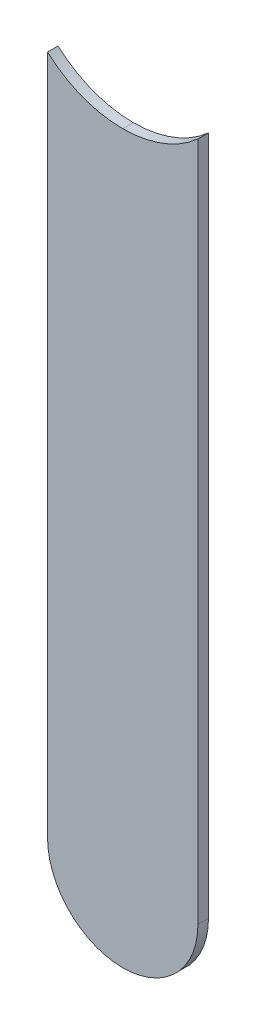
ISO-10303-21;
HEADER;
FILE_DESCRIPTION(('STEP AP214'),'2;1');
FILE_NAME('part.step','',(''),(''),'','','');
FILE_SCHEMA(('AUTOMOTIVE_DESIGN { 1 0 10303 214 1 1 1 1 }'));
ENDSEC;
DATA;
#1=APPLICATION_CONTEXT('core data for automotive mechanical design processes');
#2=APPLICATION_PROTOCOL_DEFINITION('international standard','automotive_design',2000,#1);
#3=PRODUCT_CONTEXT('',#1,'mechanical');
#4=PRODUCT('Part','Part','',(#3));
#5=PRODUCT_RELATED_PRODUCT_CATEGORY('part','',(#4));
#6=PRODUCT_DEFINITION_FORMATION('','',#4);
#7=PRODUCT_DEFINITION_CONTEXT('part definition',#1,'design');
#8=PRODUCT_DEFINITION('design','',#6,#7);
#9=PRODUCT_DEFINITION_SHAPE('','',#8);
#10=(LENGTH_UNIT() NAMED_UNIT(*) SI_UNIT(.MILLI.,.METRE.));
#11=(NAMED_UNIT(*) PLANE_ANGLE_UNIT() SI_UNIT($,.RADIAN.));
#12=(NAMED_UNIT(*) SI_UNIT($,.STERADIAN.) SOLID_ANGLE_UNIT());
#13=UNCERTAINTY_MEASURE_WITH_UNIT(LENGTH_MEASURE(1.E-05),#10,'distance_accuracy_value','');
#14=(GEOMETRIC_REPRESENTATION_CONTEXT(3) GLOBAL_UNCERTAINTY_ASSIGNED_CONTEXT((#13)) GLOBAL_UNIT_ASSIGNED_CONTEXT((#10,
#11,#12)) REPRESENTATION_CONTEXT('',''));
#15=CARTESIAN_POINT('',(0.,0.,0.));
#16=DIRECTION('',(0.,0.,1.));
#17=DIRECTION('',(1.,0.,0.));
#18=AXIS2_PLACEMENT_3D('',#15,#16,#17);
#19=CARTESIAN_POINT('',(147.32,-103.632,-0.045));
#20=DIRECTION('',(0.,0.,-1.));
#21=DIRECTION('',(0.,-1.,0.));
#22=AXIS2_PLACEMENT_3D('',#19,#20,#21);
#23=CYLINDRICAL_SURFACE('',#22,0.375);
#24=DIRECTION('',(0.,0.,1.));
#25=VECTOR('',#24,1.);
#26=CARTESIAN_POINT('',(147.32,-104.007,-0.045));
#27=LINE('',#26,#25);
#28=CARTESIAN_POINT('',(147.32,-104.007,-0.035));
#29=VERTEX_POINT('',#28);
#30=CARTESIAN_POINT('',(147.32,-104.007,0.));
#31=VERTEX_POINT('',#30);
#32=EDGE_CURVE('E84',#29,#31,#27,.T.);
#33=ORIENTED_EDGE('',*,*,#32,.F.);
#34=CARTESIAN_POINT('',(147.32,-103.632,-0.035));
#35=DIRECTION('',(0.,0.,-1.));
#36=DIRECTION('',(0.,-1.,0.));
#37=AXIS2_PLACEMENT_3D('',#34,#35,#36);
#38=CIRCLE('',#37,0.375);
#39=CARTESIAN_POINT('',(147.07,-103.9115084972,-0.035));
#40=VERTEX_POINT('',#39);
#41=EDGE_CURVE('E124',#29,#40,#38,.T.);
#42=ORIENTED_EDGE('',*,*,#41,.T.);
#43=DIRECTION('',(0.,0.,-1.));
#44=VECTOR('',#43,1.);
#45=CARTESIAN_POINT('',(147.07,-103.9115084971,-0.045));
#46=LINE('',#45,#44);
#47=CARTESIAN_POINT('',(147.07,-103.9115084972,0.));
#48=VERTEX_POINT('',#47);
#49=EDGE_CURVE('E11',#48,#40,#46,.T.);
#50=ORIENTED_EDGE('',*,*,#49,.F.);
#51=CARTESIAN_POINT('',(147.32,-103.632,0.));
#52=DIRECTION('',(0.,0.,-1.));
#53=DIRECTION('',(0.,-1.,0.));
#54=AXIS2_PLACEMENT_3D('',#51,#52,#53);
#55=CIRCLE('',#54,0.375);
#56=EDGE_CURVE('E110',#31,#48,#55,.T.);
#57=ORIENTED_EDGE('',*,*,#56,.F.);
#58=EDGE_LOOP('',(#33,#42,#50,#57));
#59=FACE_BOUND('',#58,.T.);
#60=ADVANCED_FACE('F17',(#59),#23,.F.);
#61=CARTESIAN_POINT('',(147.07,-103.632,-0.035));
#62=DIRECTION('',(1.,0.,0.));
#63=DIRECTION('',(0.,1.,0.));
#64=AXIS2_PLACEMENT_3D('',#61,#62,#63);
#65=PLANE('',#64);
#66=DIRECTION('',(0.,0.,1.));
#67=VECTOR('',#66,1.);
#68=CARTESIAN_POINT('',(147.07,-106.172,-0.035));
#69=LINE('',#68,#67);
#70=CARTESIAN_POINT('',(147.07,-106.172,-0.035));
#71=VERTEX_POINT('',#70);
#72=CARTESIAN_POINT('',(147.07,-106.172,0.));
#73=VERTEX_POINT('',#72);
#74=EDGE_CURVE('E25',#71,#73,#69,.T.);
#75=ORIENTED_EDGE('',*,*,#74,.T.);
#76=DIRECTION('',(0.,-1.,0.));
#77=VECTOR('',#76,1.);
#78=CARTESIAN_POINT('',(147.07,-103.632,0.));
#79=LINE('',#78,#77);
#80=EDGE_CURVE('E112',#48,#73,#79,.T.);
#81=ORIENTED_EDGE('',*,*,#80,.F.);
#82=ORIENTED_EDGE('',*,*,#49,.T.);
#83=DIRECTION('',(0.,-1.,0.));
#84=VECTOR('',#83,1.);
#85=CARTESIAN_POINT('',(147.07,-103.632,-0.035));
#86=LINE('',#85,#84);
#87=EDGE_CURVE('E121',#40,#71,#86,.T.);
#88=ORIENTED_EDGE('',*,*,#87,.T.);
#89=EDGE_LOOP('',(#75,#81,#82,#88));
#90=FACE_BOUND('',#89,.T.);
#91=ADVANCED_FACE('F224',(#90),#65,.F.);
#92=CARTESIAN_POINT('',(147.32,-106.172,-0.035));
#93=DIRECTION('',(0.,0.,-1.));
#94=DIRECTION('',(-1.,0.,0.));
#95=AXIS2_PLACEMENT_3D('',#92,#93,#94);
#96=CYLINDRICAL_SURFACE('',#95,0.25);
#97=CARTESIAN_POINT('',(147.32,-106.172,-0.035));
#98=DIRECTION('',(0.,0.,1.));
#99=DIRECTION('',(-1.,0.,0.));
#100=AXIS2_PLACEMENT_3D('',#97,#98,#99);
#101=CIRCLE('',#100,0.25);
#102=CARTESIAN_POINT('',(147.57,-106.172,-0.035));
#103=VERTEX_POINT('',#102);
#104=EDGE_CURVE('E120',#71,#103,#101,.T.);
#105=ORIENTED_EDGE('',*,*,#104,.T.);
#106=DIRECTION('',(0.,0.,1.));
#107=VECTOR('',#106,1.);
#108=CARTESIAN_POINT('',(147.57,-106.172,-0.035));
#109=LINE('',#108,#107);
#110=CARTESIAN_POINT('',(147.57,-106.172,0.));
#111=VERTEX_POINT('',#110);
#112=EDGE_CURVE('E98',#103,#111,#109,.T.);
#113=ORIENTED_EDGE('',*,*,#112,.T.);
#114=CARTESIAN_POINT('',(147.32,-106.172,0.));
#115=DIRECTION('',(0.,0.,1.));
#116=DIRECTION('',(-1.,0.,0.));
#117=AXIS2_PLACEMENT_3D('',#114,#115,#116);
#118=CIRCLE('',#117,0.25);
#119=EDGE_CURVE('E88',#73,#111,#118,.T.);
#120=ORIENTED_EDGE('',*,*,#119,.F.);
#121=ORIENTED_EDGE('',*,*,#74,.F.);
#122=EDGE_LOOP('',(#105,#113,#120,#121));
#123=FACE_BOUND('',#122,.T.);
#124=ADVANCED_FACE('F216',(#123),#96,.T.);
#125=CARTESIAN_POINT('',(147.57,-106.172,0.));
#126=DIRECTION('',(0.,0.,1.));
#127=DIRECTION('',(1.,0.,0.));
#128=AXIS2_PLACEMENT_3D('',#125,#126,#127);
#129=PLANE('',#128);
#130=ORIENTED_EDGE('',*,*,#119,.T.);
#131=DIRECTION('',(0.,1.,0.));
#132=VECTOR('',#131,1.);
#133=CARTESIAN_POINT('',(147.57,-106.172,0.));
#134=LINE('',#133,#132);
#135=CARTESIAN_POINT('',(147.57,-103.9115084972,0.));
#136=VERTEX_POINT('',#135);
#137=EDGE_CURVE('E91',#111,#136,#134,.T.);
#138=ORIENTED_EDGE('',*,*,#137,.T.);
#139=CARTESIAN_POINT('',(147.32,-103.632,0.));
#140=DIRECTION('',(0.,0.,-1.));
#141=DIRECTION('',(0.,-1.,0.));
#142=AXIS2_PLACEMENT_3D('',#139,#140,#141);
#143=CIRCLE('',#142,0.375);
#144=EDGE_CURVE('E78',#136,#31,#143,.T.);
#145=ORIENTED_EDGE('',*,*,#144,.T.);
#146=ORIENTED_EDGE('',*,*,#56,.T.);
#147=ORIENTED_EDGE('',*,*,#80,.T.);
#148=EDGE_LOOP('',(#130,#138,#145,#146,#147));
#149=FACE_BOUND('',#148,.T.);
#150=ADVANCED_FACE('F92',(#149),#129,.T.);
#151=CARTESIAN_POINT('',(147.32,-103.632,-0.045));
#152=DIRECTION('',(0.,0.,-1.));
#153=DIRECTION('',(0.,-1.,0.));
#154=AXIS2_PLACEMENT_3D('',#151,#152,#153);
#155=CYLINDRICAL_SURFACE('',#154,0.375);
#156=CARTESIAN_POINT('',(147.32,-103.632,-0.035));
#157=DIRECTION('',(0.,0.,-1.));
#158=DIRECTION('',(0.,-1.,0.));
#159=AXIS2_PLACEMENT_3D('',#156,#157,#158);
#160=CIRCLE('',#159,0.375);
#161=CARTESIAN_POINT('',(147.57,-103.9115084972,-0.035));
#162=VERTEX_POINT('',#161);
#163=EDGE_CURVE('E129',#162,#29,#160,.T.);
#164=ORIENTED_EDGE('',*,*,#163,.T.);
#165=ORIENTED_EDGE('',*,*,#32,.T.);
#166=ORIENTED_EDGE('',*,*,#144,.F.);
#167=DIRECTION('',(0.,0.,-1.));
#168=VECTOR('',#167,1.);
#169=CARTESIAN_POINT('',(147.57,-103.9115084971,-0.045));
#170=LINE('',#169,#168);
#171=EDGE_CURVE('E83',#136,#162,#170,.T.);
#172=ORIENTED_EDGE('',*,*,#171,.T.);
#173=EDGE_LOOP('',(#164,#165,#166,#172));
#174=FACE_BOUND('',#173,.T.);
#175=ADVANCED_FACE('F81',(#174),#155,.F.);
#176=CARTESIAN_POINT('',(147.57,-106.172,-0.035));
#177=DIRECTION('',(0.,0.,1.));
#178=DIRECTION('',(1.,0.,0.));
#179=AXIS2_PLACEMENT_3D('',#176,#177,#178);
#180=PLANE('',#179);
#181=ORIENTED_EDGE('',*,*,#87,.F.);
#182=ORIENTED_EDGE('',*,*,#41,.F.);
#183=ORIENTED_EDGE('',*,*,#163,.F.);
#184=DIRECTION('',(0.,1.,0.));
#185=VECTOR('',#184,1.);
#186=CARTESIAN_POINT('',(147.57,-106.172,-0.035));
#187=LINE('',#186,#185);
#188=EDGE_CURVE('E103',#103,#162,#187,.T.);
#189=ORIENTED_EDGE('',*,*,#188,.F.);
#190=ORIENTED_EDGE('',*,*,#104,.F.);
#191=EDGE_LOOP('',(#181,#182,#183,#189,#190));
#192=FACE_BOUND('',#191,.T.);
#193=ADVANCED_FACE('F188',(#192),#180,.F.);
#194=CARTESIAN_POINT('',(147.57,-106.172,-0.035));
#195=DIRECTION('',(-1.,0.,0.));
#196=DIRECTION('',(0.,0.,1.));
#197=AXIS2_PLACEMENT_3D('',#194,#195,#196);
#198=PLANE('',#197);
#199=ORIENTED_EDGE('',*,*,#171,.F.);
#200=ORIENTED_EDGE('',*,*,#137,.F.);
#201=ORIENTED_EDGE('',*,*,#112,.F.);
#202=ORIENTED_EDGE('',*,*,#188,.T.);
#203=EDGE_LOOP('',(#199,#200,#201,#202));
#204=FACE_BOUND('',#203,.T.);
#205=ADVANCED_FACE('F101',(#204),#198,.F.);
#206=CLOSED_SHELL('',(#60,#91,#124,#150,#175,#193,#205));
#207=MANIFOLD_SOLID_BREP('B1',#206);
#208=ADVANCED_BREP_SHAPE_REPRESENTATION('',(#18,#207),#14);
#209=SHAPE_DEFINITION_REPRESENTATION(#9,#208);
ENDSEC;
END-ISO-10303-21;
